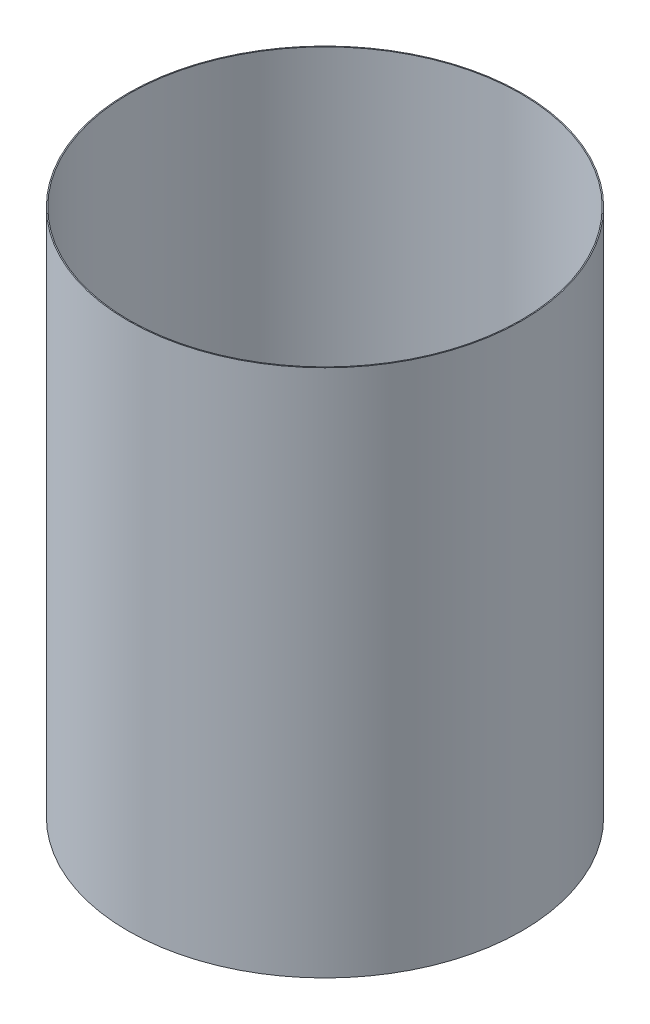
ISO-10303-21;
HEADER;
FILE_DESCRIPTION(('STEP AP214'),'2;1');
FILE_NAME('part.step','',(''),(''),'','','');
FILE_SCHEMA(('AUTOMOTIVE_DESIGN { 1 0 10303 214 1 1 1 1 }'));
ENDSEC;
DATA;
#1=APPLICATION_CONTEXT('core data for automotive mechanical design processes');
#2=APPLICATION_PROTOCOL_DEFINITION('international standard','automotive_design',2000,#1);
#3=PRODUCT_CONTEXT('',#1,'mechanical');
#4=PRODUCT('Part','Part','',(#3));
#5=PRODUCT_RELATED_PRODUCT_CATEGORY('part','',(#4));
#6=PRODUCT_DEFINITION_FORMATION('','',#4);
#7=PRODUCT_DEFINITION_CONTEXT('part definition',#1,'design');
#8=PRODUCT_DEFINITION('design','',#6,#7);
#9=PRODUCT_DEFINITION_SHAPE('','',#8);
#10=(LENGTH_UNIT() NAMED_UNIT(*) SI_UNIT(.MILLI.,.METRE.));
#11=(NAMED_UNIT(*) PLANE_ANGLE_UNIT() SI_UNIT($,.RADIAN.));
#12=(NAMED_UNIT(*) SI_UNIT($,.STERADIAN.) SOLID_ANGLE_UNIT());
#13=UNCERTAINTY_MEASURE_WITH_UNIT(LENGTH_MEASURE(1.E-05),#10,'distance_accuracy_value','');
#14=(GEOMETRIC_REPRESENTATION_CONTEXT(3) GLOBAL_UNCERTAINTY_ASSIGNED_CONTEXT((#13)) GLOBAL_UNIT_ASSIGNED_CONTEXT((#10,
#11,#12)) REPRESENTATION_CONTEXT('',''));
#15=CARTESIAN_POINT('',(0.,0.,0.));
#16=DIRECTION('',(0.,0.,1.));
#17=DIRECTION('',(1.,0.,0.));
#18=AXIS2_PLACEMENT_3D('',#15,#16,#17);
#19=CARTESIAN_POINT('',(0.,55.,0.));
#20=DIRECTION('',(0.,1.,0.));
#21=DIRECTION('',(0.,0.,1.));
#22=AXIS2_PLACEMENT_3D('',#19,#20,#21);
#23=CYLINDRICAL_SURFACE('',#22,49.7205);
#24=CARTESIAN_POINT('',(0.,-153.255914232196,0.));
#25=DIRECTION('',(0.,1.,0.));
#26=DIRECTION('',(0.,0.,1.));
#27=AXIS2_PLACEMENT_3D('',#24,#25,#26);
#28=CIRCLE('',#27,49.7205);
#29=CARTESIAN_POINT('',(0.,-153.255914232196,49.7205));
#30=VERTEX_POINT('',#29);
#31=EDGE_CURVE('E45',#30,#30,#28,.T.);
#32=ORIENTED_EDGE('',*,*,#31,.T.);
#33=EDGE_LOOP('',(#32));
#34=FACE_BOUND('',#33,.T.);
#35=CARTESIAN_POINT('',(0.,-19.905914232196,0.));
#36=DIRECTION('',(0.,1.,0.));
#37=DIRECTION('',(0.,0.,1.));
#38=AXIS2_PLACEMENT_3D('',#35,#36,#37);
#39=CIRCLE('',#38,49.7205);
#40=CARTESIAN_POINT('',(0.,-19.905914232196,49.7205));
#41=VERTEX_POINT('',#40);
#42=EDGE_CURVE('E10',#41,#41,#39,.T.);
#43=ORIENTED_EDGE('',*,*,#42,.F.);
#44=EDGE_LOOP('',(#43));
#45=FACE_BOUND('',#44,.T.);
#46=ADVANCED_FACE('F31',(#34,#45),#23,.T.);
#47=CARTESIAN_POINT('',(-49.7205,-19.905914232196,0.));
#48=DIRECTION('',(0.,-1.,0.));
#49=DIRECTION('',(0.,0.,-1.));
#50=AXIS2_PLACEMENT_3D('',#47,#48,#49);
#51=PLANE('',#50);
#52=CARTESIAN_POINT('',(0.,-19.905914232196,0.));
#53=DIRECTION('',(0.,1.,0.));
#54=DIRECTION('',(0.,0.,1.));
#55=AXIS2_PLACEMENT_3D('',#52,#53,#54);
#56=CIRCLE('',#55,49.4665);
#57=CARTESIAN_POINT('',(0.,-19.905914232196,49.4665));
#58=VERTEX_POINT('',#57);
#59=EDGE_CURVE('E37',#58,#58,#56,.T.);
#60=ORIENTED_EDGE('',*,*,#59,.F.);
#61=EDGE_LOOP('',(#60));
#62=FACE_BOUND('',#61,.T.);
#63=ORIENTED_EDGE('',*,*,#42,.T.);
#64=EDGE_LOOP('',(#63));
#65=FACE_BOUND('',#64,.T.);
#66=ADVANCED_FACE('F61',(#62,#65),#51,.F.);
#67=CARTESIAN_POINT('',(0.,55.,0.));
#68=DIRECTION('',(0.,1.,0.));
#69=DIRECTION('',(0.,0.,1.));
#70=AXIS2_PLACEMENT_3D('',#67,#68,#69);
#71=CYLINDRICAL_SURFACE('',#70,49.4665);
#72=CARTESIAN_POINT('',(0.,-153.255914232196,0.));
#73=DIRECTION('',(0.,1.,0.));
#74=DIRECTION('',(0.,0.,1.));
#75=AXIS2_PLACEMENT_3D('',#72,#73,#74);
#76=CIRCLE('',#75,49.4665);
#77=CARTESIAN_POINT('',(0.,-153.255914232196,49.4665));
#78=VERTEX_POINT('',#77);
#79=EDGE_CURVE('E41',#78,#78,#76,.T.);
#80=ORIENTED_EDGE('',*,*,#79,.F.);
#81=EDGE_LOOP('',(#80));
#82=FACE_BOUND('',#81,.T.);
#83=ORIENTED_EDGE('',*,*,#59,.T.);
#84=EDGE_LOOP('',(#83));
#85=FACE_BOUND('',#84,.T.);
#86=ADVANCED_FACE('F56',(#82,#85),#71,.F.);
#87=CARTESIAN_POINT('',(-49.4665,-153.255914232196,0.));
#88=DIRECTION('',(0.,1.,0.));
#89=DIRECTION('',(0.,0.,1.));
#90=AXIS2_PLACEMENT_3D('',#87,#88,#89);
#91=PLANE('',#90);
#92=ORIENTED_EDGE('',*,*,#31,.F.);
#93=EDGE_LOOP('',(#92));
#94=FACE_BOUND('',#93,.T.);
#95=ORIENTED_EDGE('',*,*,#79,.T.);
#96=EDGE_LOOP('',(#95));
#97=FACE_BOUND('',#96,.T.);
#98=ADVANCED_FACE('F53',(#94,#97),#91,.F.);
#99=CLOSED_SHELL('',(#46,#66,#86,#98));
#100=MANIFOLD_SOLID_BREP('B2',#99);
#101=ADVANCED_BREP_SHAPE_REPRESENTATION('',(#18,#100),#14);
#102=SHAPE_DEFINITION_REPRESENTATION(#9,#101);
ENDSEC;
END-ISO-10303-21;
